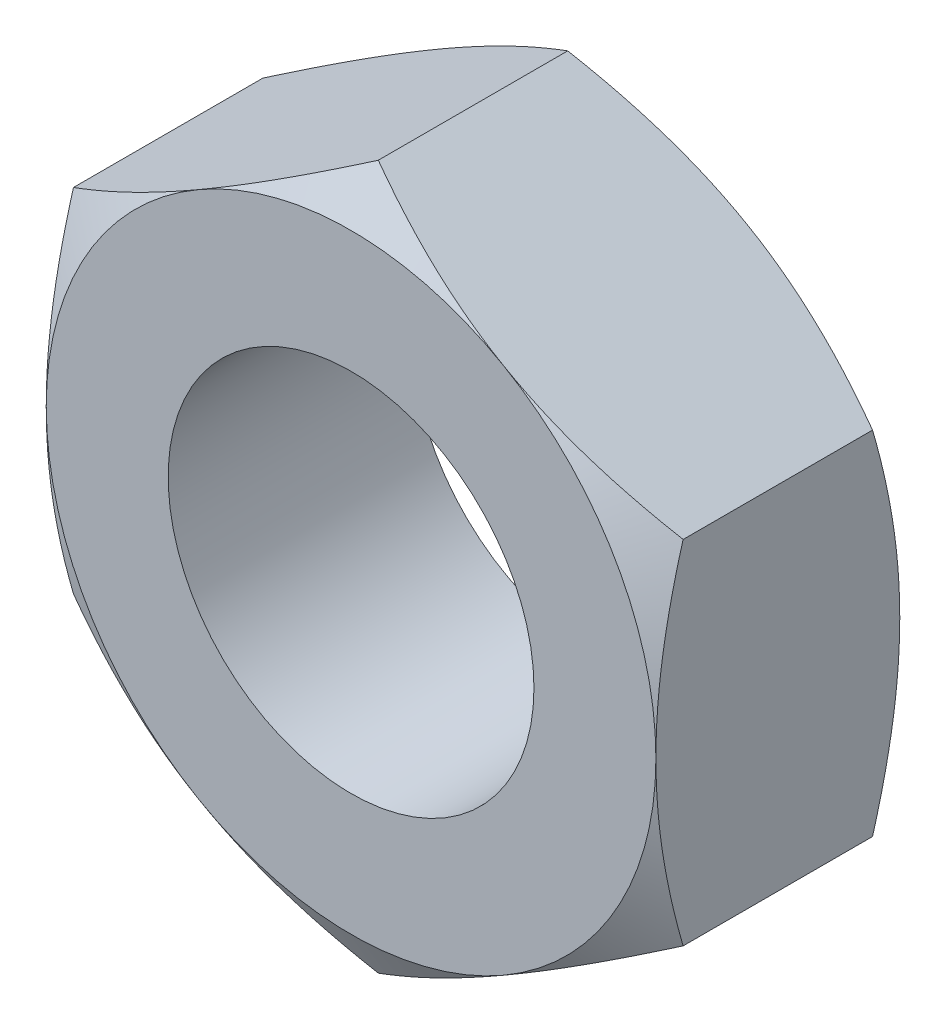
ISO-10303-21;
HEADER;
FILE_DESCRIPTION(('STEP AP214'),'2;1');
FILE_NAME('part.step','',(''),(''),'','','');
FILE_SCHEMA(('AUTOMOTIVE_DESIGN { 1 0 10303 214 1 1 1 1 }'));
ENDSEC;
DATA;
#1=APPLICATION_CONTEXT('core data for automotive mechanical design processes');
#2=APPLICATION_PROTOCOL_DEFINITION('international standard','automotive_design',2000,#1);
#3=PRODUCT_CONTEXT('',#1,'mechanical');
#4=PRODUCT('Part','Part','',(#3));
#5=PRODUCT_RELATED_PRODUCT_CATEGORY('part','',(#4));
#6=PRODUCT_DEFINITION_FORMATION('','',#4);
#7=PRODUCT_DEFINITION_CONTEXT('part definition',#1,'design');
#8=PRODUCT_DEFINITION('design','',#6,#7);
#9=PRODUCT_DEFINITION_SHAPE('','',#8);
#10=(LENGTH_UNIT() NAMED_UNIT(*) SI_UNIT(.MILLI.,.METRE.));
#11=(NAMED_UNIT(*) PLANE_ANGLE_UNIT() SI_UNIT($,.RADIAN.));
#12=(NAMED_UNIT(*) SI_UNIT($,.STERADIAN.) SOLID_ANGLE_UNIT());
#13=UNCERTAINTY_MEASURE_WITH_UNIT(LENGTH_MEASURE(1.E-05),#10,'distance_accuracy_value','');
#14=(GEOMETRIC_REPRESENTATION_CONTEXT(3) GLOBAL_UNCERTAINTY_ASSIGNED_CONTEXT((#13)) GLOBAL_UNIT_ASSIGNED_CONTEXT((#10,
#11,#12)) REPRESENTATION_CONTEXT('',''));
#15=CARTESIAN_POINT('',(0.,0.,0.));
#16=DIRECTION('',(0.,0.,1.));
#17=DIRECTION('',(1.,0.,0.));
#18=AXIS2_PLACEMENT_3D('',#15,#16,#17);
#19=CARTESIAN_POINT('',(-2.49999999999997,-1.44337567297409,2.));
#20=DIRECTION('',(0.499999999999995,0.866025403784441,0.));
#21=DIRECTION('',(-0.866025403784442,0.499999999999995,0.));
#22=AXIS2_PLACEMENT_3D('',#19,#20,#21);
#23=PLANE('',#22);
#24=CARTESIAN_POINT('',(0.000200000000000162,-2.88686681600195,0.2233576643591));
#25=CARTESIAN_POINT('',(-0.109663234734871,-2.82343724785373,0.186721620107618));
#26=CARTESIAN_POINT('',(-0.220474799896525,-2.75946016087833,0.153402218965049));
#27=CARTESIAN_POINT('',(-0.444016833466049,-2.63039810762177,0.0952422855578519));
#28=CARTESIAN_POINT('',(-0.556751274528388,-2.56531084772749,0.0704223291477331));
#29=CARTESIAN_POINT('',(-0.780822993875268,-2.43594298024479,0.0317856514410478));
#30=CARTESIAN_POINT('',(-0.892125791767376,-2.37168227992022,0.0177117961856351));
#31=CARTESIAN_POINT('',(-1.11525522746833,-2.24285844015414,0.000909152352747347));
#32=CARTESIAN_POINT('',(-1.22708105401423,-2.17829576909552,-0.00183354879637574));
#33=CARTESIAN_POINT('',(-1.43604197555152,-2.05765212479586,0.00386576000805192));
#34=CARTESIAN_POINT('',(-1.53320831755773,-2.0015531110824,0.0109083943818601));
#35=CARTESIAN_POINT('',(-1.72690794971099,-1.88972057631678,0.0332314191249406));
#36=CARTESIAN_POINT('',(-1.82344056965972,-1.83398744220381,0.0485194384402649));
#37=CARTESIAN_POINT('',(-2.01753972174046,-1.72192424450051,0.086739093844417));
#38=CARTESIAN_POINT('',(-2.11508168178212,-1.66560836761318,0.109832776125513));
#39=CARTESIAN_POINT('',(-2.30871060807606,-1.55381665489447,0.162246656577907));
#40=CARTESIAN_POINT('',(-2.40480005588615,-1.49833938633504,0.191554535624541));
#41=CARTESIAN_POINT('',(-2.50019999999997,-1.44326020292025,0.2233576643591));
#42=B_SPLINE_CURVE_WITH_KNOTS('',3,(#24,#25,#26,#27,#28,#29,#30,#31,#32,#33,#34,#35,#36,#37,#38,
#39,#40,#41),.UNSPECIFIED.,.F.,.F.,(4,2,2,2,2,2,2,2,4),(0.,0.396285827362224,0.793524330152047,
1.18093086852113,1.56786160134475,1.90479741793731,2.2420455166046,2.58677531536753,
2.93082800105252),.UNSPECIFIED.);
#43=CARTESIAN_POINT('',(0.,-2.88675134594811,0.223290993692593));
#44=VERTEX_POINT('',#43);
#45=CARTESIAN_POINT('',(-1.24999999999999,-2.1650635094611,0.));
#46=VERTEX_POINT('',#45);
#47=EDGE_CURVE('E267',#44,#46,#42,.T.);
#48=ORIENTED_EDGE('',*,*,#47,.F.);
#49=DIRECTION('',(0.,0.,-1.));
#50=VECTOR('',#49,1.);
#51=CARTESIAN_POINT('',(0.,-2.88675134594811,2.));
#52=LINE('',#51,#50);
#53=CARTESIAN_POINT('',(0.,-2.88675134594811,1.77670900630741));
#54=VERTEX_POINT('',#53);
#55=EDGE_CURVE('E310',#54,#44,#52,.T.);
#56=ORIENTED_EDGE('',*,*,#55,.F.);
#57=CARTESIAN_POINT('',(-2.50019999999997,-1.44326020292025,1.7766423356409));
#58=CARTESIAN_POINT('',(-2.3903367652651,-1.50668977106847,1.81327837989238));
#59=CARTESIAN_POINT('',(-2.27952520010345,-1.57066685804387,1.84659778103495));
#60=CARTESIAN_POINT('',(-2.05598316653392,-1.69972891130043,1.90475771444215));
#61=CARTESIAN_POINT('',(-1.94324872547158,-1.76481617119471,1.92957767085227));
#62=CARTESIAN_POINT('',(-1.7191770061247,-1.89418403867742,1.96821434855895));
#63=CARTESIAN_POINT('',(-1.60787420823259,-1.95844473900198,1.98228820381436));
#64=CARTESIAN_POINT('',(-1.38474477253164,-2.08726857876806,1.99909084764725));
#65=CARTESIAN_POINT('',(-1.27291894598575,-2.15183124982668,2.00183354879638));
#66=CARTESIAN_POINT('',(-1.06395802444845,-2.27247489412635,1.99613423999195));
#67=CARTESIAN_POINT('',(-0.966791682442246,-2.3285739078398,1.98909160561814));
#68=CARTESIAN_POINT('',(-0.773092050288979,-2.44040644260542,1.96676858087506));
#69=CARTESIAN_POINT('',(-0.676559430340252,-2.4961395767184,1.95148056155974));
#70=CARTESIAN_POINT('',(-0.482460278259513,-2.60820277442169,1.91326090615558));
#71=CARTESIAN_POINT('',(-0.38491831821785,-2.66451865130902,1.89016722387449));
#72=CARTESIAN_POINT('',(-0.19128939192391,-2.77631036402773,1.83775334342209));
#73=CARTESIAN_POINT('',(-0.0951999441138213,-2.83178763258716,1.80844546437546));
#74=CARTESIAN_POINT('',(0.000200000000000241,-2.88686681600195,1.7766423356409));
#75=B_SPLINE_CURVE_WITH_KNOTS('',3,(#57,#58,#59,#60,#61,#62,#63,#64,#65,#66,#67,#68,#69,#70,#71,
#72,#73,#74),.UNSPECIFIED.,.F.,.F.,(4,2,2,2,2,2,2,2,4),(0.,0.396285827362225,0.793524330152047,
1.18093086852113,1.56786160134475,1.90479741793731,2.2420455166046,2.58677531536753,
2.93082800105252),.UNSPECIFIED.);
#76=CARTESIAN_POINT('',(-1.24999999999999,-2.1650635094611,2.));
#77=VERTEX_POINT('',#76);
#78=EDGE_CURVE('E217',#77,#54,#75,.T.);
#79=ORIENTED_EDGE('',*,*,#78,.F.);
#80=CARTESIAN_POINT('',(-2.49999999999997,-1.44337567297421,1.77670900630749));
#81=VERTEX_POINT('',#80);
#82=EDGE_CURVE('E293',#81,#77,#75,.T.);
#83=ORIENTED_EDGE('',*,*,#82,.F.);
#84=DIRECTION('',(0.,0.,-1.));
#85=VECTOR('',#84,1.);
#86=CARTESIAN_POINT('',(-2.49999999999997,-1.44337567297409,2.));
#87=LINE('',#86,#85);
#88=CARTESIAN_POINT('',(-2.49999999999997,-1.44337567297421,0.223290993692512));
#89=VERTEX_POINT('',#88);
#90=EDGE_CURVE('E290',#81,#89,#87,.T.);
#91=ORIENTED_EDGE('',*,*,#90,.T.);
#92=EDGE_CURVE('E254',#46,#89,#42,.T.);
#93=ORIENTED_EDGE('',*,*,#92,.F.);
#94=EDGE_LOOP('',(#48,#56,#79,#83,#91,#93));
#95=FACE_BOUND('',#94,.T.);
#96=ADVANCED_FACE('F37',(#95),#23,.F.);
#97=CARTESIAN_POINT('',(0.,-2.88675134594811,2.));
#98=DIRECTION('',(-0.500000000000001,0.866025403784438,0.));
#99=DIRECTION('',(-0.866025403784438,-0.500000000000001,0.));
#100=AXIS2_PLACEMENT_3D('',#97,#98,#99);
#101=PLANE('',#100);
#102=CARTESIAN_POINT('',(2.50019999999999,-1.44326020292021,0.2233576643591));
#103=CARTESIAN_POINT('',(2.39033676526512,-1.50668977106843,0.186721620107618));
#104=CARTESIAN_POINT('',(2.27952520010347,-1.57066685804384,0.153402218965048));
#105=CARTESIAN_POINT('',(2.05598316653394,-1.6997289113004,0.0952422855578497));
#106=CARTESIAN_POINT('',(1.94324872547161,-1.76481617119468,0.0704223291477302));
#107=CARTESIAN_POINT('',(1.71917700612473,-1.89418403867739,0.0317856514410439));
#108=CARTESIAN_POINT('',(1.60787420823262,-1.95844473900195,0.0177117961856309));
#109=CARTESIAN_POINT('',(1.38474477253166,-2.08726857876803,0.000909152352742216));
#110=CARTESIAN_POINT('',(1.27291894598577,-2.15183124982665,-0.00183354879638143));
#111=CARTESIAN_POINT('',(1.06395802444848,-2.27247489412632,0.00386576000804523));
#112=CARTESIAN_POINT('',(0.966791682442268,-2.32857390783978,0.0109083943818532));
#113=CARTESIAN_POINT('',(0.773092050288997,-2.4404064426054,0.033231419124934));
#114=CARTESIAN_POINT('',(0.676559430340268,-2.49613957671838,0.0485194384402587));
#115=CARTESIAN_POINT('',(0.482460278259524,-2.60820277442168,0.0867390938444119));
#116=CARTESIAN_POINT('',(0.384918318217859,-2.66451865130902,0.109832776125509));
#117=CARTESIAN_POINT('',(0.191289391923915,-2.77631036402772,0.162246656577905));
#118=CARTESIAN_POINT('',(0.0951999441138241,-2.83178763258716,0.19155453562454));
#119=CARTESIAN_POINT('',(-0.000199999999999883,-2.88686681600195,0.2233576643591));
#120=B_SPLINE_CURVE_WITH_KNOTS('',3,(#102,#103,#104,#105,#106,#107,#108,#109,#110,#111,#112,
#113,#114,#115,#116,#117,#118,#119),.UNSPECIFIED.,.F.,.F.,(4,2,2,2,2,2,2,2,4),(0.,
0.396285827362225,0.793524330152047,1.18093086852113,1.56786160134475,1.90479741793732,
2.24204551660462,2.58677531536755,2.93082800105256),.UNSPECIFIED.);
#121=CARTESIAN_POINT('',(2.49999999999999,-1.44337567297405,0.223290993692593));
#122=VERTEX_POINT('',#121);
#123=CARTESIAN_POINT('',(1.25,-2.1650635094611,0.));
#124=VERTEX_POINT('',#123);
#125=EDGE_CURVE('E145',#122,#124,#120,.T.);
#126=ORIENTED_EDGE('',*,*,#125,.F.);
#127=DIRECTION('',(0.,0.,-1.));
#128=VECTOR('',#127,1.);
#129=CARTESIAN_POINT('',(2.49999999999999,-1.44337567297405,2.));
#130=LINE('',#129,#128);
#131=CARTESIAN_POINT('',(2.49999999999999,-1.44337567297417,1.77670900630749));
#132=VERTEX_POINT('',#131);
#133=EDGE_CURVE('E157',#132,#122,#130,.T.);
#134=ORIENTED_EDGE('',*,*,#133,.F.);
#135=CARTESIAN_POINT('',(-0.000200000000000074,-2.88686681600195,1.7766423356409));
#136=CARTESIAN_POINT('',(0.10966323473487,-2.82343724785373,1.81327837989238));
#137=CARTESIAN_POINT('',(0.220474799896524,-2.75946016087833,1.84659778103495));
#138=CARTESIAN_POINT('',(0.444016833466047,-2.63039810762177,1.90475771444215));
#139=CARTESIAN_POINT('',(0.556751274528385,-2.56531084772748,1.92957767085227));
#140=CARTESIAN_POINT('',(0.780822993875264,-2.43594298024478,1.96821434855896));
#141=CARTESIAN_POINT('',(0.892125791767372,-2.37168227992021,1.98228820381437));
#142=CARTESIAN_POINT('',(1.11525522746833,-2.24285844015414,1.99909084764726));
#143=CARTESIAN_POINT('',(1.22708105401422,-2.17829576909551,2.00183354879638));
#144=CARTESIAN_POINT('',(1.43604197555151,-2.05765212479585,1.99613423999195));
#145=CARTESIAN_POINT('',(1.53320831755772,-2.00155311108239,1.98909160561815));
#146=CARTESIAN_POINT('',(1.72690794971099,-1.88972057631677,1.96676858087507));
#147=CARTESIAN_POINT('',(1.82344056965972,-1.83398744220379,1.95148056155974));
#148=CARTESIAN_POINT('',(2.01753972174047,-1.72192424450049,1.91326090615559));
#149=CARTESIAN_POINT('',(2.11508168178213,-1.66560836761315,1.89016722387449));
#150=CARTESIAN_POINT('',(2.30871060807608,-1.55381665489444,1.8377533434221));
#151=CARTESIAN_POINT('',(2.40480005588617,-1.49833938633501,1.80844546437546));
#152=CARTESIAN_POINT('',(2.50019999999999,-1.44326020292021,1.7766423356409));
#153=B_SPLINE_CURVE_WITH_KNOTS('',3,(#135,#136,#137,#138,#139,#140,#141,#142,#143,#144,#145,
#146,#147,#148,#149,#150,#151,#152),.UNSPECIFIED.,.F.,.F.,(4,2,2,2,2,2,2,2,4),(0.,
0.396285827362224,0.793524330152047,1.18093086852113,1.56786160134475,1.90479741793732,
2.24204551660462,2.58677531536755,2.93082800105256),.UNSPECIFIED.);
#154=CARTESIAN_POINT('',(1.25,-2.16506350946108,2.));
#155=VERTEX_POINT('',#154);
#156=EDGE_CURVE('E200',#155,#132,#153,.T.);
#157=ORIENTED_EDGE('',*,*,#156,.F.);
#158=EDGE_CURVE('E334',#54,#155,#153,.T.);
#159=ORIENTED_EDGE('',*,*,#158,.F.);
#160=ORIENTED_EDGE('',*,*,#55,.T.);
#161=EDGE_CURVE('E167',#124,#44,#120,.T.);
#162=ORIENTED_EDGE('',*,*,#161,.F.);
#163=EDGE_LOOP('',(#126,#134,#157,#159,#160,#162));
#164=FACE_BOUND('',#163,.T.);
#165=ADVANCED_FACE('F180',(#164),#101,.F.);
#166=CARTESIAN_POINT('',(2.49999999999999,-1.44337567297405,2.));
#167=DIRECTION('',(-1.,0.,0.));
#168=DIRECTION('',(0.,-1.,0.));
#169=AXIS2_PLACEMENT_3D('',#166,#167,#168);
#170=PLANE('',#169);
#171=CARTESIAN_POINT('',(2.5,-3.93425573570174,1.24786742231988));
#172=CARTESIAN_POINT('',(2.5,-3.82455805271518,1.19442683286789));
#173=CARTESIAN_POINT('',(2.5,-3.71461458124995,1.1414824250811));
#174=CARTESIAN_POINT('',(2.5,-3.49410553801961,1.03686398179162));
#175=CARTESIAN_POINT('',(2.5,-3.38353987636771,0.985190135952728));
#176=CARTESIAN_POINT('',(2.5,-3.1611133721341,0.883143029913734));
#177=CARTESIAN_POINT('',(2.5,-3.04924878665415,0.832777900698826));
#178=CARTESIAN_POINT('',(2.5,-2.8246495074574,0.734034164431113));
#179=CARTESIAN_POINT('',(2.5,-2.71191485354297,0.685655467138938));
#180=CARTESIAN_POINT('',(2.49999999999999,-2.4815726289783,0.589816347587659));
#181=CARTESIAN_POINT('',(2.49999999999999,-2.36392903093314,0.542442056681136));
#182=CARTESIAN_POINT('',(2.49999999999999,-2.12728680673992,0.451142480581939));
#183=CARTESIAN_POINT('',(2.49999999999999,-2.00828803339158,0.407217574235718));
#184=CARTESIAN_POINT('',(2.49999999999999,-1.76895086303134,0.323927966543298));
#185=CARTESIAN_POINT('',(2.49999999999999,-1.64861554144244,0.284554513885219));
#186=CARTESIAN_POINT('',(2.49999999999999,-1.40621964850133,0.21159319438697));
#187=CARTESIAN_POINT('',(2.49999999999999,-1.28415961496497,0.178003565258964));
#188=CARTESIAN_POINT('',(2.49999999999999,-1.0389195188697,0.118361804718263));
#189=CARTESIAN_POINT('',(2.49999999999999,-0.915749874741587,0.0922676059427502));
#190=CARTESIAN_POINT('',(2.49999999999999,-0.667820858109997,0.0490550373819117));
#191=CARTESIAN_POINT('',(2.49999999999999,-0.543061659325973,0.0319356952253109));
#192=CARTESIAN_POINT('',(2.49999999999999,-0.294229286789481,0.00825976303698975));
#193=CARTESIAN_POINT('',(2.49999999999999,-0.170169796196182,0.0015629187993084));
#194=CARTESIAN_POINT('',(2.49999999999999,0.0780766731615942,-0.00107330125971436));
#195=CARTESIAN_POINT('',(2.49999999999999,0.202263653840971,0.00298748693341116));
#196=CARTESIAN_POINT('',(2.49999999999998,0.411409604725348,0.0185927331632678));
#197=CARTESIAN_POINT('',(2.49999999999998,0.496584671497748,0.0274243081141329));
#198=CARTESIAN_POINT('',(2.49999999999998,0.666344730959548,0.0496284777980075));
#199=CARTESIAN_POINT('',(2.49999999999998,0.750929648415659,0.063001641083345));
#200=CARTESIAN_POINT('',(2.49999999999998,1.00366548007522,0.109234028667318));
#201=CARTESIAN_POINT('',(2.49999999999998,1.17071375552299,0.148199044449048));
#202=CARTESIAN_POINT('',(2.49999999999998,1.4206286514283,0.216203518781425));
#203=CARTESIAN_POINT('',(2.49999999999998,1.50477790209398,0.240801494595756));
#204=CARTESIAN_POINT('',(2.49999999999998,1.67225987920894,0.292660070165323));
#205=CARTESIAN_POINT('',(2.49999999999998,1.75559259937951,0.319920690377339));
#206=CARTESIAN_POINT('',(2.49999999999998,1.92146681890304,0.376658162164918));
#207=CARTESIAN_POINT('',(2.49999999999998,2.00400853495824,0.406134385980853));
#208=CARTESIAN_POINT('',(2.49999999999998,2.16840002368736,0.466945522238705));
#209=CARTESIAN_POINT('',(2.49999999999998,2.25024981200959,0.498280392517164));
#210=CARTESIAN_POINT('',(2.49999999999998,2.47007598379912,0.584843598085943));
#211=CARTESIAN_POINT('',(2.49999999999998,2.60747896260624,0.641526709598319));
#212=CARTESIAN_POINT('',(2.49999999999998,2.88087320813983,0.758212721815775));
#213=CARTESIAN_POINT('',(2.49999999999998,3.01686431759797,0.818215987739867));
#214=CARTESIAN_POINT('',(2.49999999999997,3.28775371033888,0.940755016909798));
#215=CARTESIAN_POINT('',(2.49999999999997,3.42265159883759,1.00329165002619));
#216=CARTESIAN_POINT('',(2.49999999999997,3.69153349617871,1.13030325926438));
#217=CARTESIAN_POINT('',(2.49999999999997,3.82551747693042,1.19477829464024));
#218=CARTESIAN_POINT('',(2.49999999999997,4.22678780318403,1.39065285591914));
#219=CARTESIAN_POINT('',(2.49999999999997,4.49297167508688,1.52430796749618));
#220=CARTESIAN_POINT('',(2.49999999999997,5.02332787108775,1.79538779124832));
#221=CARTESIAN_POINT('',(2.49999999999997,5.28750060208648,1.93281171353398));
#222=CARTESIAN_POINT('',(2.49999999999997,5.78669441053013,2.19560284746361));
#223=CARTESIAN_POINT('',(2.49999999999997,6.02185115865901,2.32071278514315));
#224=CARTESIAN_POINT('',(2.49999999999996,6.49137306636739,2.57244119196158));
#225=CARTESIAN_POINT('',(2.49999999999996,6.7257381764787,2.69905975321281));
#226=CARTESIAN_POINT('',(2.49999999999996,7.19307672107728,2.95299069470952));
#227=CARTESIAN_POINT('',(2.49999999999996,7.42605218847075,3.08029933799));
#228=CARTESIAN_POINT('',(2.49999999999996,7.89150863123006,3.33577450416362));
#229=CARTESIAN_POINT('',(2.49999999999996,8.12398964405185,3.46394095878685));
#230=CARTESIAN_POINT('',(2.49999999999996,8.35629687842252,3.59241944863064));
#231=B_SPLINE_CURVE_WITH_KNOTS('',3,(#171,#172,#173,#174,#175,#176,#177,#178,#179,#180,#181,
#182,#183,#184,#185,#186,#187,#188,#189,#190,#191,#192,#193,#194,#195,#196,#197,#198,#199,#200,
#201,#202,#203,#204,#205,#206,#207,#208,#209,#210,#211,#212,#213,#214,#215,#216,#217,#218,#219,
#220,#221,#222,#223,#224,#225,#226,#227,#228,#229,#230),.UNSPECIFIED.,.F.,.F.,(4,2,2,2,2,2,2,2,
2,2,2,2,2,2,2,2,2,2,2,2,2,2,2,2,2,2,2,2,2,4),(0.,0.366071555956611,0.732197429693603,
1.10022131466406,1.46822846255462,1.84865877257403,2.22913080704688,2.60885867248576,
2.98847063215674,3.36590845840163,3.74330538309199,4.11557841167118,4.4878571160823,
4.74462879425845,5.00143262902233,5.51529120295764,5.7782794978535,6.04126981341614,
6.30418589329148,6.56709601118611,7.01293774320754,7.45882861596655,7.9048739119297,
8.35093285672014,9.24444046413292,10.1377622149405,10.9368546431961,11.7359961144143,
12.5324647674532,13.3288707690047),.UNSPECIFIED.);
#232=CARTESIAN_POINT('',(2.49999999999998,1.44337567297407,0.223290993692593));
#233=VERTEX_POINT('',#232);
#234=CARTESIAN_POINT('',(2.5,0.,0.));
#235=VERTEX_POINT('',#234);
#236=EDGE_CURVE('E126',#233,#235,#231,.F.);
#237=ORIENTED_EDGE('',*,*,#236,.F.);
#238=DIRECTION('',(0.,0.,-1.));
#239=VECTOR('',#238,1.);
#240=CARTESIAN_POINT('',(2.49999999999998,1.44337567297407,2.));
#241=LINE('',#240,#239);
#242=CARTESIAN_POINT('',(2.49999999999998,1.44337567297407,1.77670900630741));
#243=VERTEX_POINT('',#242);
#244=EDGE_CURVE('E308',#243,#233,#241,.T.);
#245=ORIENTED_EDGE('',*,*,#244,.F.);
#246=CARTESIAN_POINT('',(2.5,-3.93425573570174,0.752132577680122));
#247=CARTESIAN_POINT('',(2.5,-3.82455805271518,0.805573167132106));
#248=CARTESIAN_POINT('',(2.5,-3.71461458124995,0.858517574918903));
#249=CARTESIAN_POINT('',(2.5,-3.49410553801961,0.96313601820838));
#250=CARTESIAN_POINT('',(2.5,-3.3835398763677,1.01480986404727));
#251=CARTESIAN_POINT('',(2.5,-3.1611133721341,1.11685697008627));
#252=CARTESIAN_POINT('',(2.5,-3.04924878665415,1.16722209930117));
#253=CARTESIAN_POINT('',(2.5,-2.8246495074574,1.26596583556889));
#254=CARTESIAN_POINT('',(2.5,-2.71191485354297,1.31434453286106));
#255=CARTESIAN_POINT('',(2.49999999999999,-2.4815726289783,1.41018365241234));
#256=CARTESIAN_POINT('',(2.49999999999999,-2.36392903093314,1.45755794331886));
#257=CARTESIAN_POINT('',(2.49999999999999,-2.12728680673992,1.54885751941806));
#258=CARTESIAN_POINT('',(2.49999999999999,-2.00828803339158,1.59278242576428));
#259=CARTESIAN_POINT('',(2.49999999999999,-1.76895086303134,1.6760720334567));
#260=CARTESIAN_POINT('',(2.49999999999999,-1.64861554144244,1.71544548611478));
#261=CARTESIAN_POINT('',(2.49999999999999,-1.40621964850133,1.78840680561303));
#262=CARTESIAN_POINT('',(2.49999999999999,-1.28415961496497,1.82199643474104));
#263=CARTESIAN_POINT('',(2.49999999999999,-1.0389195188697,1.88163819528174));
#264=CARTESIAN_POINT('',(2.49999999999999,-0.915749874741587,1.90773239405725));
#265=CARTESIAN_POINT('',(2.49999999999999,-0.667820858109997,1.95094496261809));
#266=CARTESIAN_POINT('',(2.49999999999999,-0.543061659325972,1.96806430477469));
#267=CARTESIAN_POINT('',(2.49999999999999,-0.294229286789481,1.99174023696301));
#268=CARTESIAN_POINT('',(2.49999999999999,-0.170169796196181,1.99843708120069));
#269=CARTESIAN_POINT('',(2.49999999999999,0.0780766731615949,2.00107330125971));
#270=CARTESIAN_POINT('',(2.49999999999999,0.202263653840971,1.99701251306659));
#271=CARTESIAN_POINT('',(2.49999999999998,0.411409604725348,1.98140726683673));
#272=CARTESIAN_POINT('',(2.49999999999998,0.496584671497748,1.97257569188587));
#273=CARTESIAN_POINT('',(2.49999999999998,0.666344730959547,1.95037152220199));
#274=CARTESIAN_POINT('',(2.49999999999998,0.750929648415658,1.93699835891666));
#275=CARTESIAN_POINT('',(2.49999999999998,1.00366548007522,1.89076597133268));
#276=CARTESIAN_POINT('',(2.49999999999998,1.17071375552299,1.85180095555095));
#277=CARTESIAN_POINT('',(2.49999999999998,1.4206286514283,1.78379648121857));
#278=CARTESIAN_POINT('',(2.49999999999998,1.50477790209398,1.75919850540424));
#279=CARTESIAN_POINT('',(2.49999999999998,1.67225987920894,1.70733992983468));
#280=CARTESIAN_POINT('',(2.49999999999998,1.75559259937951,1.68007930962266));
#281=CARTESIAN_POINT('',(2.49999999999998,1.92146681890304,1.62334183783508));
#282=CARTESIAN_POINT('',(2.49999999999998,2.00400853495824,1.59386561401915));
#283=CARTESIAN_POINT('',(2.49999999999998,2.16840002368736,1.53305447776129));
#284=CARTESIAN_POINT('',(2.49999999999998,2.25024981200959,1.50171960748284));
#285=CARTESIAN_POINT('',(2.49999999999998,2.47007598379913,1.41515640191406));
#286=CARTESIAN_POINT('',(2.49999999999998,2.60747896260624,1.35847329040168));
#287=CARTESIAN_POINT('',(2.49999999999998,2.88087320813983,1.24178727818422));
#288=CARTESIAN_POINT('',(2.49999999999998,3.01686431759797,1.18178401226013));
#289=CARTESIAN_POINT('',(2.49999999999997,3.28775371033888,1.0592449830902));
#290=CARTESIAN_POINT('',(2.49999999999997,3.42265159883759,0.996708349973814));
#291=CARTESIAN_POINT('',(2.49999999999997,3.69153349617871,0.86969674073562));
#292=CARTESIAN_POINT('',(2.49999999999997,3.82551747693042,0.805221705359762));
#293=CARTESIAN_POINT('',(2.49999999999997,4.22678780318403,0.609347144080856));
#294=CARTESIAN_POINT('',(2.49999999999997,4.49297167508688,0.475692032503817));
#295=CARTESIAN_POINT('',(2.49999999999997,5.02332787108775,0.204612208751678));
#296=CARTESIAN_POINT('',(2.49999999999997,5.28750060208648,0.0671882864660215));
#297=CARTESIAN_POINT('',(2.49999999999997,5.78669441053013,-0.195602847463607));
#298=CARTESIAN_POINT('',(2.49999999999997,6.02185115865901,-0.320712785143147));
#299=CARTESIAN_POINT('',(2.49999999999996,6.49137306636739,-0.572441191961576));
#300=CARTESIAN_POINT('',(2.49999999999996,6.7257381764787,-0.699059753212815));
#301=CARTESIAN_POINT('',(2.49999999999996,7.19307672107728,-0.952990694709516));
#302=CARTESIAN_POINT('',(2.49999999999996,7.42605218847075,-1.08029933799));
#303=CARTESIAN_POINT('',(2.49999999999996,7.89150863123006,-1.33577450416362));
#304=CARTESIAN_POINT('',(2.49999999999996,8.12398964405185,-1.46394095878685));
#305=CARTESIAN_POINT('',(2.49999999999996,8.35629687842252,-1.59241944863064));
#306=B_SPLINE_CURVE_WITH_KNOTS('',3,(#246,#247,#248,#249,#250,#251,#252,#253,#254,#255,#256,
#257,#258,#259,#260,#261,#262,#263,#264,#265,#266,#267,#268,#269,#270,#271,#272,#273,#274,#275,
#276,#277,#278,#279,#280,#281,#282,#283,#284,#285,#286,#287,#288,#289,#290,#291,#292,#293,#294,
#295,#296,#297,#298,#299,#300,#301,#302,#303,#304,#305),.UNSPECIFIED.,.F.,.F.,(4,2,2,2,2,2,2,2,
2,2,2,2,2,2,2,2,2,2,2,2,2,2,2,2,2,2,2,2,2,4),(0.,0.366071555956611,0.732197429693603,
1.10022131466407,1.46822846255462,1.84865877257403,2.22913080704688,2.60885867248576,
2.98847063215674,3.36590845840163,3.74330538309199,4.11557841167118,4.4878571160823,
4.74462879425845,5.00143262902233,5.51529120295764,5.7782794978535,6.04126981341614,
6.30418589329148,6.56709601118611,7.01293774320754,7.45882861596655,7.9048739119297,
8.35093285672014,9.24444046413292,10.1377622149405,10.9368546431961,11.7359961144143,
12.5324647674532,13.3288707690047),.UNSPECIFIED.);
#307=CARTESIAN_POINT('',(2.49999999999999,0.,2.));
#308=VERTEX_POINT('',#307);
#309=EDGE_CURVE('E186',#308,#243,#306,.T.);
#310=ORIENTED_EDGE('',*,*,#309,.F.);
#311=EDGE_CURVE('E193',#132,#308,#306,.T.);
#312=ORIENTED_EDGE('',*,*,#311,.F.);
#313=ORIENTED_EDGE('',*,*,#133,.T.);
#314=EDGE_CURVE('E138',#235,#122,#231,.F.);
#315=ORIENTED_EDGE('',*,*,#314,.F.);
#316=EDGE_LOOP('',(#237,#245,#310,#312,#313,#315));
#317=FACE_BOUND('',#316,.T.);
#318=ADVANCED_FACE('F154',(#317),#170,.F.);
#319=CARTESIAN_POINT('',(2.49999999999998,1.44337567297407,2.));
#320=DIRECTION('',(-0.499999999999995,-0.866025403784442,0.));
#321=DIRECTION('',(0.866025403784442,-0.499999999999995,0.));
#322=AXIS2_PLACEMENT_3D('',#319,#320,#321);
#323=PLANE('',#322);
#324=CARTESIAN_POINT('',(-0.000200000000020158,2.88686681600195,0.2233576643591));
#325=CARTESIAN_POINT('',(0.109663234734851,2.82343724785373,0.186721620107617));
#326=CARTESIAN_POINT('',(0.220474799896505,2.75946016087833,0.153402218965048));
#327=CARTESIAN_POINT('',(0.444016833466029,2.63039810762177,0.0952422855578498));
#328=CARTESIAN_POINT('',(0.556751274528367,2.56531084772749,0.0704223291477303));
#329=CARTESIAN_POINT('',(0.780822993875247,2.43594298024479,0.0317856514410441));
#330=CARTESIAN_POINT('',(0.892125791767355,2.37168227992022,0.017711796185631));
#331=CARTESIAN_POINT('',(1.11525522746831,2.24285844015414,0.000909152352742206));
#332=CARTESIAN_POINT('',(1.2270810540142,2.17829576909552,-0.00183354879638151));
#333=CARTESIAN_POINT('',(1.4360419755515,2.05765212479586,0.00386576000804518));
#334=CARTESIAN_POINT('',(1.53320831755771,2.0015531110824,0.0109083943818533));
#335=CARTESIAN_POINT('',(1.72690794971098,1.88972057631678,0.033231419124934));
#336=CARTESIAN_POINT('',(1.82344056965971,1.8339874422038,0.0485194384402585));
#337=CARTESIAN_POINT('',(2.01753972174046,1.7219242445005,0.0867390938444117));
#338=CARTESIAN_POINT('',(2.11508168178212,1.66560836761317,0.109832776125508));
#339=CARTESIAN_POINT('',(2.30871060807607,1.55381665489446,0.162246656577905));
#340=CARTESIAN_POINT('',(2.40480005588616,1.49833938633502,0.19155453562454));
#341=CARTESIAN_POINT('',(2.50019999999998,1.44326020292023,0.2233576643591));
#342=B_SPLINE_CURVE_WITH_KNOTS('',3,(#324,#325,#326,#327,#328,#329,#330,#331,#332,#333,#334,
#335,#336,#337,#338,#339,#340,#341),.UNSPECIFIED.,.F.,.F.,(4,2,2,2,2,2,2,2,4),(0.,
0.396285827362224,0.793524330152047,1.18093086852113,1.56786160134475,1.90479741793732,
2.24204551660462,2.58677531536755,2.93082800105256),.UNSPECIFIED.);
#343=CARTESIAN_POINT('',(0.,2.88675134594811,0.223290993692593));
#344=VERTEX_POINT('',#343);
#345=CARTESIAN_POINT('',(1.24999999999999,2.1650635094611,0.));
#346=VERTEX_POINT('',#345);
#347=EDGE_CURVE('E53',#344,#346,#342,.T.);
#348=ORIENTED_EDGE('',*,*,#347,.F.);
#349=DIRECTION('',(0.,0.,-1.));
#350=VECTOR('',#349,1.);
#351=CARTESIAN_POINT('',(0.,2.88675134594811,2.));
#352=LINE('',#351,#350);
#353=CARTESIAN_POINT('',(0.,2.88675134594811,1.77670900630741));
#354=VERTEX_POINT('',#353);
#355=EDGE_CURVE('E300',#354,#344,#352,.T.);
#356=ORIENTED_EDGE('',*,*,#355,.F.);
#357=CARTESIAN_POINT('',(2.50019999999998,1.44326020292023,1.7766423356409));
#358=CARTESIAN_POINT('',(2.39033676526511,1.50668977106845,1.81327837989238));
#359=CARTESIAN_POINT('',(2.27952520010346,1.57066685804385,1.84659778103495));
#360=CARTESIAN_POINT('',(2.05598316653393,1.69972891130041,1.90475771444215));
#361=CARTESIAN_POINT('',(1.94324872547159,1.7648161711947,1.92957767085227));
#362=CARTESIAN_POINT('',(1.71917700612471,1.8941840386774,1.96821434855896));
#363=CARTESIAN_POINT('',(1.60787420823261,1.95844473900196,1.98228820381437));
#364=CARTESIAN_POINT('',(1.38474477253165,2.08726857876804,1.99909084764726));
#365=CARTESIAN_POINT('',(1.27291894598576,2.15183124982666,2.00183354879638));
#366=CARTESIAN_POINT('',(1.06395802444846,2.27247489412633,1.99613423999195));
#367=CARTESIAN_POINT('',(0.966791682442252,2.32857390783979,1.98909160561815));
#368=CARTESIAN_POINT('',(0.77309205028898,2.44040644260541,1.96676858087507));
#369=CARTESIAN_POINT('',(0.67655943034025,2.49613957671839,1.95148056155974));
#370=CARTESIAN_POINT('',(0.482460278259505,2.60820277442168,1.91326090615559));
#371=CARTESIAN_POINT('',(0.384918318217841,2.66451865130902,1.89016722387449));
#372=CARTESIAN_POINT('',(0.191289391923895,2.77631036402772,1.8377533434221));
#373=CARTESIAN_POINT('',(0.0951999441138043,2.83178763258716,1.80844546437546));
#374=CARTESIAN_POINT('',(-0.000200000000020008,2.88686681600195,1.7766423356409));
#375=B_SPLINE_CURVE_WITH_KNOTS('',3,(#357,#358,#359,#360,#361,#362,#363,#364,#365,#366,#367,
#368,#369,#370,#371,#372,#373,#374),.UNSPECIFIED.,.F.,.F.,(4,2,2,2,2,2,2,2,4),(0.,
0.396285827362225,0.793524330152047,1.18093086852113,1.56786160134475,1.90479741793732,
2.24204551660462,2.58677531536755,2.93082800105256),.UNSPECIFIED.);
#376=CARTESIAN_POINT('',(1.24999999999998,2.16506350946109,2.));
#377=VERTEX_POINT('',#376);
#378=EDGE_CURVE('E195',#377,#354,#375,.T.);
#379=ORIENTED_EDGE('',*,*,#378,.F.);
#380=EDGE_CURVE('E194',#243,#377,#375,.T.);
#381=ORIENTED_EDGE('',*,*,#380,.F.);
#382=ORIENTED_EDGE('',*,*,#244,.T.);
#383=EDGE_CURVE('E132',#346,#233,#342,.T.);
#384=ORIENTED_EDGE('',*,*,#383,.F.);
#385=EDGE_LOOP('',(#348,#356,#379,#381,#382,#384));
#386=FACE_BOUND('',#385,.T.);
#387=ADVANCED_FACE('F179',(#386),#323,.F.);
#388=CARTESIAN_POINT('',(0.,2.88675134594811,2.));
#389=DIRECTION('',(0.500000000000007,-0.866025403784435,0.));
#390=DIRECTION('',(0.866025403784434,0.500000000000007,0.));
#391=AXIS2_PLACEMENT_3D('',#388,#389,#390);
#392=PLANE('',#391);
#393=CARTESIAN_POINT('',(-2.5002,1.4432602029202,0.2233576643591));
#394=CARTESIAN_POINT('',(-2.39033676526513,1.50668977106842,0.186721620107617));
#395=CARTESIAN_POINT('',(-2.27952520010348,1.57066685804382,0.153402218965048));
#396=CARTESIAN_POINT('',(-2.05598316653396,1.69972891130039,0.0952422855578498));
#397=CARTESIAN_POINT('',(-1.94324872547162,1.76481617119467,0.0704223291477304));
#398=CARTESIAN_POINT('',(-1.71917700612474,1.89418403867737,0.0317856514410441));
#399=CARTESIAN_POINT('',(-1.60787420823263,1.95844473900194,0.0177117961856308));
#400=CARTESIAN_POINT('',(-1.38474477253168,2.08726857876802,0.000909152352742026));
#401=CARTESIAN_POINT('',(-1.27291894598579,2.15183124982664,-0.00183354879638151));
#402=CARTESIAN_POINT('',(-1.0639580244485,2.27247489412631,0.00386576000804529));
#403=CARTESIAN_POINT('',(-0.966791682442284,2.32857390783977,0.0109083943818533));
#404=CARTESIAN_POINT('',(-0.773092050289014,2.4404064426054,0.0332314191249341));
#405=CARTESIAN_POINT('',(-0.676559430340285,2.49613957671838,0.0485194384402587));
#406=CARTESIAN_POINT('',(-0.482460278259542,2.60820277442167,0.0867390938444119));
#407=CARTESIAN_POINT('',(-0.384918318217878,2.66451865130901,0.109832776125509));
#408=CARTESIAN_POINT('',(-0.191289391923934,2.77631036402772,0.162246656577905));
#409=CARTESIAN_POINT('',(-0.0951999441138436,2.83178763258716,0.19155453562454));
#410=CARTESIAN_POINT('',(0.000199999999980036,2.88686681600195,0.2233576643591));
#411=B_SPLINE_CURVE_WITH_KNOTS('',3,(#393,#394,#395,#396,#397,#398,#399,#400,#401,#402,#403,
#404,#405,#406,#407,#408,#409,#410),.UNSPECIFIED.,.F.,.F.,(4,2,2,2,2,2,2,2,4),(0.,
0.396285827362225,0.793524330152046,1.18093086852113,1.56786160134475,1.90479741793732,
2.24204551660462,2.58677531536755,2.93082800105256),.UNSPECIFIED.);
#412=CARTESIAN_POINT('',(-2.5,1.44337567297403,0.223290993692593));
#413=VERTEX_POINT('',#412);
#414=CARTESIAN_POINT('',(-1.25000000000002,2.16506350946109,0.));
#415=VERTEX_POINT('',#414);
#416=EDGE_CURVE('E60',#413,#415,#411,.T.);
#417=ORIENTED_EDGE('',*,*,#416,.F.);
#418=DIRECTION('',(0.,0.,-1.));
#419=VECTOR('',#418,1.);
#420=CARTESIAN_POINT('',(-2.5,1.44337567297403,2.));
#421=LINE('',#420,#419);
#422=CARTESIAN_POINT('',(-2.5,1.44337567297403,1.77670900630741));
#423=VERTEX_POINT('',#422);
#424=EDGE_CURVE('E296',#423,#413,#421,.T.);
#425=ORIENTED_EDGE('',*,*,#424,.F.);
#426=CARTESIAN_POINT('',(0.000199999999979915,2.88686681600195,1.7766423356409));
#427=CARTESIAN_POINT('',(-0.10966323473489,2.82343724785373,1.81327837989238));
#428=CARTESIAN_POINT('',(-0.220474799896544,2.75946016087833,1.84659778103495));
#429=CARTESIAN_POINT('',(-0.444016833466065,2.63039810762176,1.90475771444215));
#430=CARTESIAN_POINT('',(-0.556751274528403,2.56531084772748,1.92957767085227));
#431=CARTESIAN_POINT('',(-0.780822993875281,2.43594298024477,1.96821434855896));
#432=CARTESIAN_POINT('',(-0.892125791767388,2.37168227992021,1.98228820381437));
#433=CARTESIAN_POINT('',(-1.11525522746834,2.24285844015413,1.99909084764726));
#434=CARTESIAN_POINT('',(-1.22708105401423,2.17829576909551,2.00183354879638));
#435=CARTESIAN_POINT('',(-1.43604197555153,2.05765212479584,1.99613423999195));
#436=CARTESIAN_POINT('',(-1.53320831755774,2.00155311108238,1.98909160561815));
#437=CARTESIAN_POINT('',(-1.72690794971101,1.88972057631675,1.96676858087507));
#438=CARTESIAN_POINT('',(-1.82344056965974,1.83398744220377,1.95148056155974));
#439=CARTESIAN_POINT('',(-2.01753972174048,1.72192424450048,1.91326090615559));
#440=CARTESIAN_POINT('',(-2.11508168178214,1.66560836761314,1.89016722387449));
#441=CARTESIAN_POINT('',(-2.30871060807609,1.55381665489443,1.8377533434221));
#442=CARTESIAN_POINT('',(-2.40480005588618,1.49833938633499,1.80844546437546));
#443=CARTESIAN_POINT('',(-2.5002,1.4432602029202,1.7766423356409));
#444=B_SPLINE_CURVE_WITH_KNOTS('',3,(#426,#427,#428,#429,#430,#431,#432,#433,#434,#435,#436,
#437,#438,#439,#440,#441,#442,#443),.UNSPECIFIED.,.F.,.F.,(4,2,2,2,2,2,2,2,4),(0.,
0.396285827362225,0.793524330152047,1.18093086852113,1.56786160134475,1.90479741793732,
2.24204551660462,2.58677531536755,2.93082800105256),.UNSPECIFIED.);
#445=CARTESIAN_POINT('',(-1.25000000000001,2.16506350946107,2.));
#446=VERTEX_POINT('',#445);
#447=EDGE_CURVE('E233',#446,#423,#444,.T.);
#448=ORIENTED_EDGE('',*,*,#447,.F.);
#449=EDGE_CURVE('E238',#354,#446,#444,.T.);
#450=ORIENTED_EDGE('',*,*,#449,.F.);
#451=ORIENTED_EDGE('',*,*,#355,.T.);
#452=EDGE_CURVE('E256',#415,#344,#411,.T.);
#453=ORIENTED_EDGE('',*,*,#452,.F.);
#454=EDGE_LOOP('',(#417,#425,#448,#450,#451,#453));
#455=FACE_BOUND('',#454,.T.);
#456=ADVANCED_FACE('F239',(#455),#392,.F.);
#457=CARTESIAN_POINT('',(-2.5,1.44337567297403,2.));
#458=DIRECTION('',(1.,0.,0.));
#459=DIRECTION('',(0.,1.,0.));
#460=AXIS2_PLACEMENT_3D('',#457,#458,#459);
#461=PLANE('',#460);
#462=CARTESIAN_POINT('',(-2.49999999999995,-3.93425573570178,1.24786742231988));
#463=CARTESIAN_POINT('',(-2.49999999999995,-3.82455805271521,1.19442683286789));
#464=CARTESIAN_POINT('',(-2.49999999999995,-3.71461458124999,1.1414824250811));
#465=CARTESIAN_POINT('',(-2.49999999999995,-3.49410553801965,1.03686398179162));
#466=CARTESIAN_POINT('',(-2.49999999999995,-3.38353987636774,0.985190135952728));
#467=CARTESIAN_POINT('',(-2.49999999999995,-3.16111337213413,0.883143029913734));
#468=CARTESIAN_POINT('',(-2.49999999999995,-3.04924878665418,0.832777900698826));
#469=CARTESIAN_POINT('',(-2.49999999999996,-2.82464950745744,0.734034164431113));
#470=CARTESIAN_POINT('',(-2.49999999999996,-2.711914853543,0.685655467138938));
#471=CARTESIAN_POINT('',(-2.49999999999996,-2.48157262897833,0.589816347587658));
#472=CARTESIAN_POINT('',(-2.49999999999996,-2.36392903093318,0.542442056681136));
#473=CARTESIAN_POINT('',(-2.49999999999996,-2.12728680673995,0.451142480581939));
#474=CARTESIAN_POINT('',(-2.49999999999997,-2.00828803339161,0.407217574235718));
#475=CARTESIAN_POINT('',(-2.49999999999997,-1.76895086303137,0.323927966543298));
#476=CARTESIAN_POINT('',(-2.49999999999997,-1.64861554144248,0.284554513885218));
#477=CARTESIAN_POINT('',(-2.49999999999997,-1.40621964850137,0.21159319438697));
#478=CARTESIAN_POINT('',(-2.49999999999997,-1.28415961496501,0.178003565258964));
#479=CARTESIAN_POINT('',(-2.49999999999998,-1.03891951886973,0.118361804718263));
#480=CARTESIAN_POINT('',(-2.49999999999998,-0.915749874741622,0.0922676059427501));
#481=CARTESIAN_POINT('',(-2.49999999999998,-0.667820858110031,0.0490550373819117));
#482=CARTESIAN_POINT('',(-2.49999999999998,-0.543061659326007,0.0319356952253111));
#483=CARTESIAN_POINT('',(-2.49999999999998,-0.294229286789515,0.00825976303698988));
#484=CARTESIAN_POINT('',(-2.49999999999998,-0.170169796196216,0.00156291879930829));
#485=CARTESIAN_POINT('',(-2.49999999999999,0.0780766731615602,-0.00107330125971448));
#486=CARTESIAN_POINT('',(-2.49999999999999,0.202263653840937,0.0029874869334112));
#487=CARTESIAN_POINT('',(-2.49999999999999,0.411409604725314,0.018592733163268));
#488=CARTESIAN_POINT('',(-2.49999999999999,0.496584671497714,0.0274243081141331));
#489=CARTESIAN_POINT('',(-2.49999999999999,0.666344730959513,0.0496284777980076));
#490=CARTESIAN_POINT('',(-2.49999999999999,0.750929648415624,0.0630016410833449));
#491=CARTESIAN_POINT('',(-2.5,1.00366548007519,0.109234028667318));
#492=CARTESIAN_POINT('',(-2.5,1.17071375552296,0.148199044449049));
#493=CARTESIAN_POINT('',(-2.5,1.42062865142827,0.216203518781425));
#494=CARTESIAN_POINT('',(-2.5,1.50477790209394,0.240801494595756));
#495=CARTESIAN_POINT('',(-2.5,1.67225987920891,0.292660070165323));
#496=CARTESIAN_POINT('',(-2.5,1.75559259937948,0.319920690377339));
#497=CARTESIAN_POINT('',(-2.50000000000001,1.921466818903,0.376658162164918));
#498=CARTESIAN_POINT('',(-2.50000000000001,2.00400853495821,0.406134385980853));
#499=CARTESIAN_POINT('',(-2.50000000000001,2.16840002368732,0.466945522238705));
#500=CARTESIAN_POINT('',(-2.50000000000001,2.25024981200956,0.498280392517164));
#501=CARTESIAN_POINT('',(-2.50000000000001,2.47007598379909,0.584843598085943));
#502=CARTESIAN_POINT('',(-2.50000000000001,2.6074789626062,0.641526709598319));
#503=CARTESIAN_POINT('',(-2.50000000000002,2.8808732081398,0.758212721815775));
#504=CARTESIAN_POINT('',(-2.50000000000002,3.01686431759794,0.818215987739867));
#505=CARTESIAN_POINT('',(-2.50000000000002,3.28775371033885,0.940755016909798));
#506=CARTESIAN_POINT('',(-2.50000000000002,3.42265159883755,1.00329165002619));
#507=CARTESIAN_POINT('',(-2.50000000000002,3.69153349617867,1.13030325926438));
#508=CARTESIAN_POINT('',(-2.50000000000003,3.82551747693038,1.19477829464024));
#509=CARTESIAN_POINT('',(-2.50000000000003,4.226787803184,1.39065285591914));
#510=CARTESIAN_POINT('',(-2.50000000000003,4.49297167508684,1.52430796749618));
#511=CARTESIAN_POINT('',(-2.50000000000004,5.02332787108771,1.79538779124832));
#512=CARTESIAN_POINT('',(-2.50000000000004,5.28750060208644,1.93281171353398));
#513=CARTESIAN_POINT('',(-2.50000000000005,5.78669441053009,2.19560284746361));
#514=CARTESIAN_POINT('',(-2.50000000000005,6.02185115865897,2.32071278514315));
#515=CARTESIAN_POINT('',(-2.50000000000005,6.49137306636735,2.57244119196158));
#516=CARTESIAN_POINT('',(-2.50000000000006,6.72573817647867,2.69905975321281));
#517=CARTESIAN_POINT('',(-2.50000000000006,7.19307672107724,2.95299069470952));
#518=CARTESIAN_POINT('',(-2.50000000000006,7.42605218847072,3.08029933799));
#519=CARTESIAN_POINT('',(-2.50000000000007,7.89150863123003,3.33577450416362));
#520=CARTESIAN_POINT('',(-2.50000000000007,8.12398964405182,3.46394095878685));
#521=CARTESIAN_POINT('',(-2.50000000000007,8.35629687842248,3.59241944863064));
#522=B_SPLINE_CURVE_WITH_KNOTS('',3,(#462,#463,#464,#465,#466,#467,#468,#469,#470,#471,#472,
#473,#474,#475,#476,#477,#478,#479,#480,#481,#482,#483,#484,#485,#486,#487,#488,#489,#490,#491,
#492,#493,#494,#495,#496,#497,#498,#499,#500,#501,#502,#503,#504,#505,#506,#507,#508,#509,#510,
#511,#512,#513,#514,#515,#516,#517,#518,#519,#520,#521),.UNSPECIFIED.,.F.,.F.,(4,2,2,2,2,2,2,2,
2,2,2,2,2,2,2,2,2,2,2,2,2,2,2,2,2,2,2,2,2,4),(0.,0.36607155595661,0.732197429693602,
1.10022131466406,1.46822846255462,1.84865877257403,2.22913080704688,2.60885867248576,
2.98847063215673,3.36590845840163,3.74330538309199,4.11557841167118,4.4878571160823,
4.74462879425845,5.00143262902233,5.51529120295763,5.7782794978535,6.04126981341614,
6.30418589329148,6.5670960111861,7.01293774320754,7.45882861596654,7.9048739119297,
8.35093285672014,9.24444046413291,10.1377622149405,10.936854643196,11.7359961144143,
12.5324647674532,13.3288707690047),.UNSPECIFIED.);
#523=CARTESIAN_POINT('',(-2.49999999999999,0.,0.));
#524=VERTEX_POINT('',#523);
#525=EDGE_CURVE('E255',#89,#524,#522,.T.);
#526=ORIENTED_EDGE('',*,*,#525,.F.);
#527=ORIENTED_EDGE('',*,*,#90,.F.);
#528=CARTESIAN_POINT('',(-2.49999999999995,-3.93425573570178,0.752132577680122));
#529=CARTESIAN_POINT('',(-2.49999999999995,-3.82455805271521,0.805573167132106));
#530=CARTESIAN_POINT('',(-2.49999999999995,-3.71461458124999,0.858517574918904));
#531=CARTESIAN_POINT('',(-2.49999999999995,-3.49410553801964,0.963136018208381));
#532=CARTESIAN_POINT('',(-2.49999999999995,-3.38353987636774,1.01480986404727));
#533=CARTESIAN_POINT('',(-2.49999999999995,-3.16111337213413,1.11685697008627));
#534=CARTESIAN_POINT('',(-2.49999999999995,-3.04924878665418,1.16722209930117));
#535=CARTESIAN_POINT('',(-2.49999999999996,-2.82464950745744,1.26596583556889));
#536=CARTESIAN_POINT('',(-2.49999999999996,-2.711914853543,1.31434453286106));
#537=CARTESIAN_POINT('',(-2.49999999999996,-2.48157262897833,1.41018365241234));
#538=CARTESIAN_POINT('',(-2.49999999999996,-2.36392903093317,1.45755794331887));
#539=CARTESIAN_POINT('',(-2.49999999999996,-2.12728680673995,1.54885751941806));
#540=CARTESIAN_POINT('',(-2.49999999999997,-2.00828803339161,1.59278242576428));
#541=CARTESIAN_POINT('',(-2.49999999999997,-1.76895086303137,1.6760720334567));
#542=CARTESIAN_POINT('',(-2.49999999999997,-1.64861554144248,1.71544548611478));
#543=CARTESIAN_POINT('',(-2.49999999999997,-1.40621964850137,1.78840680561303));
#544=CARTESIAN_POINT('',(-2.49999999999997,-1.28415961496501,1.82199643474104));
#545=CARTESIAN_POINT('',(-2.49999999999998,-1.03891951886973,1.88163819528174));
#546=CARTESIAN_POINT('',(-2.49999999999998,-0.915749874741622,1.90773239405725));
#547=CARTESIAN_POINT('',(-2.49999999999998,-0.667820858110031,1.95094496261809));
#548=CARTESIAN_POINT('',(-2.49999999999998,-0.543061659326007,1.96806430477469));
#549=CARTESIAN_POINT('',(-2.49999999999998,-0.294229286789515,1.99174023696301));
#550=CARTESIAN_POINT('',(-2.49999999999998,-0.170169796196215,1.99843708120069));
#551=CARTESIAN_POINT('',(-2.49999999999999,0.0780766731615604,2.00107330125971));
#552=CARTESIAN_POINT('',(-2.49999999999999,0.202263653840937,1.99701251306659));
#553=CARTESIAN_POINT('',(-2.49999999999999,0.411409604725314,1.98140726683673));
#554=CARTESIAN_POINT('',(-2.49999999999999,0.496584671497714,1.97257569188587));
#555=CARTESIAN_POINT('',(-2.49999999999999,0.666344730959513,1.95037152220199));
#556=CARTESIAN_POINT('',(-2.49999999999999,0.750929648415624,1.93699835891666));
#557=CARTESIAN_POINT('',(-2.5,1.00366548007519,1.89076597133268));
#558=CARTESIAN_POINT('',(-2.5,1.17071375552296,1.85180095555095));
#559=CARTESIAN_POINT('',(-2.5,1.42062865142827,1.78379648121857));
#560=CARTESIAN_POINT('',(-2.5,1.50477790209394,1.75919850540424));
#561=CARTESIAN_POINT('',(-2.5,1.67225987920891,1.70733992983468));
#562=CARTESIAN_POINT('',(-2.5,1.75559259937948,1.68007930962266));
#563=CARTESIAN_POINT('',(-2.50000000000001,1.921466818903,1.62334183783508));
#564=CARTESIAN_POINT('',(-2.50000000000001,2.00400853495821,1.59386561401915));
#565=CARTESIAN_POINT('',(-2.50000000000001,2.16840002368732,1.53305447776129));
#566=CARTESIAN_POINT('',(-2.50000000000001,2.25024981200956,1.50171960748284));
#567=CARTESIAN_POINT('',(-2.50000000000001,2.47007598379909,1.41515640191406));
#568=CARTESIAN_POINT('',(-2.50000000000001,2.6074789626062,1.35847329040168));
#569=CARTESIAN_POINT('',(-2.50000000000002,2.88087320813979,1.24178727818422));
#570=CARTESIAN_POINT('',(-2.50000000000002,3.01686431759793,1.18178401226013));
#571=CARTESIAN_POINT('',(-2.50000000000002,3.28775371033885,1.0592449830902));
#572=CARTESIAN_POINT('',(-2.50000000000002,3.42265159883755,0.996708349973815));
#573=CARTESIAN_POINT('',(-2.50000000000002,3.69153349617867,0.86969674073562));
#574=CARTESIAN_POINT('',(-2.50000000000003,3.82551747693038,0.805221705359763));
#575=CARTESIAN_POINT('',(-2.50000000000003,4.226787803184,0.609347144080856));
#576=CARTESIAN_POINT('',(-2.50000000000003,4.49297167508684,0.475692032503817));
#577=CARTESIAN_POINT('',(-2.50000000000004,5.02332787108771,0.204612208751677));
#578=CARTESIAN_POINT('',(-2.50000000000004,5.28750060208644,0.0671882864660208));
#579=CARTESIAN_POINT('',(-2.50000000000005,5.7866944105301,-0.195602847463608));
#580=CARTESIAN_POINT('',(-2.50000000000005,6.02185115865897,-0.320712785143147));
#581=CARTESIAN_POINT('',(-2.50000000000005,6.49137306636735,-0.572441191961576));
#582=CARTESIAN_POINT('',(-2.50000000000006,6.72573817647867,-0.699059753212814));
#583=CARTESIAN_POINT('',(-2.50000000000006,7.19307672107724,-0.952990694709516));
#584=CARTESIAN_POINT('',(-2.50000000000006,7.42605218847072,-1.08029933799));
#585=CARTESIAN_POINT('',(-2.50000000000007,7.89150863123003,-1.33577450416362));
#586=CARTESIAN_POINT('',(-2.50000000000007,8.12398964405181,-1.46394095878685));
#587=CARTESIAN_POINT('',(-2.50000000000007,8.35629687842248,-1.59241944863064));
#588=B_SPLINE_CURVE_WITH_KNOTS('',3,(#528,#529,#530,#531,#532,#533,#534,#535,#536,#537,#538,
#539,#540,#541,#542,#543,#544,#545,#546,#547,#548,#549,#550,#551,#552,#553,#554,#555,#556,#557,
#558,#559,#560,#561,#562,#563,#564,#565,#566,#567,#568,#569,#570,#571,#572,#573,#574,#575,#576,
#577,#578,#579,#580,#581,#582,#583,#584,#585,#586,#587),.UNSPECIFIED.,.F.,.F.,(4,2,2,2,2,2,2,2,
2,2,2,2,2,2,2,2,2,2,2,2,2,2,2,2,2,2,2,2,2,4),(0.,0.366071555956611,0.732197429693604,
1.10022131466406,1.46822846255462,1.84865877257403,2.22913080704688,2.60885867248576,
2.98847063215673,3.36590845840163,3.74330538309199,4.11557841167118,4.4878571160823,
4.74462879425845,5.00143262902233,5.51529120295763,5.7782794978535,6.04126981341614,
6.30418589329148,6.56709601118611,7.01293774320754,7.45882861596654,7.9048739119297,
8.35093285672014,9.24444046413292,10.1377622149405,10.9368546431961,11.7359961144143,
12.5324647674532,13.3288707690047),.UNSPECIFIED.);
#589=CARTESIAN_POINT('',(-2.49999999999999,0.,2.));
#590=VERTEX_POINT('',#589);
#591=EDGE_CURVE('E225',#590,#81,#588,.F.);
#592=ORIENTED_EDGE('',*,*,#591,.F.);
#593=EDGE_CURVE('E150',#423,#590,#588,.F.);
#594=ORIENTED_EDGE('',*,*,#593,.F.);
#595=ORIENTED_EDGE('',*,*,#424,.T.);
#596=EDGE_CURVE('E257',#524,#413,#522,.T.);
#597=ORIENTED_EDGE('',*,*,#596,.F.);
#598=EDGE_LOOP('',(#526,#527,#592,#594,#595,#597));
#599=FACE_BOUND('',#598,.T.);
#600=ADVANCED_FACE('F242',(#599),#461,.F.);
#601=CARTESIAN_POINT('',(0.,0.,0.));
#602=DIRECTION('',(0.,0.,1.));
#603=DIRECTION('',(1.,0.,0.));
#604=AXIS2_PLACEMENT_3D('',#601,#602,#603);
#605=PLANE('',#604);
#606=CARTESIAN_POINT('',(0.,0.,0.));
#607=DIRECTION('',(0.,0.,1.));
#608=DIRECTION('',(1.,0.,0.));
#609=AXIS2_PLACEMENT_3D('',#606,#607,#608);
#610=CIRCLE('',#609,1.5);
#611=CARTESIAN_POINT('',(1.5,0.,0.));
#612=VERTEX_POINT('',#611);
#613=EDGE_CURVE('E303',#612,#612,#610,.T.);
#614=ORIENTED_EDGE('',*,*,#613,.T.);
#615=EDGE_LOOP('',(#614));
#616=FACE_BOUND('',#615,.T.);
#617=CARTESIAN_POINT('',(0.,0.,0.));
#618=DIRECTION('',(0.,0.,1.));
#619=DIRECTION('',(1.,0.,0.));
#620=AXIS2_PLACEMENT_3D('',#617,#618,#619);
#621=CIRCLE('',#620,2.5);
#622=EDGE_CURVE('E12',#235,#346,#621,.T.);
#623=ORIENTED_EDGE('',*,*,#622,.F.);
#624=EDGE_CURVE('E41',#124,#235,#621,.T.);
#625=ORIENTED_EDGE('',*,*,#624,.F.);
#626=EDGE_CURVE('E149',#46,#124,#621,.T.);
#627=ORIENTED_EDGE('',*,*,#626,.F.);
#628=EDGE_CURVE('E283',#524,#46,#621,.T.);
#629=ORIENTED_EDGE('',*,*,#628,.F.);
#630=CARTESIAN_POINT('',(0.,0.,0.));
#631=DIRECTION('',(0.,0.,-1.));
#632=DIRECTION('',(-1.,0.,0.));
#633=AXIS2_PLACEMENT_3D('',#630,#631,#632);
#634=CIRCLE('',#633,2.5);
#635=EDGE_CURVE('E349',#524,#415,#634,.T.);
#636=ORIENTED_EDGE('',*,*,#635,.T.);
#637=EDGE_CURVE('E46',#346,#415,#621,.T.);
#638=ORIENTED_EDGE('',*,*,#637,.F.);
#639=EDGE_LOOP('',(#623,#625,#627,#629,#636,#638));
#640=FACE_BOUND('',#639,.T.);
#641=ADVANCED_FACE('F151',(#616,#640),#605,.F.);
#642=CARTESIAN_POINT('',(0.,0.,2.));
#643=DIRECTION('',(0.,0.,1.));
#644=DIRECTION('',(1.,0.,0.));
#645=AXIS2_PLACEMENT_3D('',#642,#643,#644);
#646=PLANE('',#645);
#647=CARTESIAN_POINT('',(0.,0.,2.));
#648=DIRECTION('',(0.,0.,1.));
#649=DIRECTION('',(1.,0.,0.));
#650=AXIS2_PLACEMENT_3D('',#647,#648,#649);
#651=CIRCLE('',#650,1.5);
#652=CARTESIAN_POINT('',(1.5,0.,2.));
#653=VERTEX_POINT('',#652);
#654=EDGE_CURVE('E297',#653,#653,#651,.T.);
#655=ORIENTED_EDGE('',*,*,#654,.F.);
#656=EDGE_LOOP('',(#655));
#657=FACE_BOUND('',#656,.T.);
#658=CARTESIAN_POINT('',(0.,0.,2.));
#659=DIRECTION('',(0.,0.,1.));
#660=DIRECTION('',(1.,0.,0.));
#661=AXIS2_PLACEMENT_3D('',#658,#659,#660);
#662=CIRCLE('',#661,2.5);
#663=EDGE_CURVE('E137',#155,#308,#662,.T.);
#664=ORIENTED_EDGE('',*,*,#663,.T.);
#665=EDGE_CURVE('E172',#308,#377,#662,.T.);
#666=ORIENTED_EDGE('',*,*,#665,.T.);
#667=EDGE_CURVE('E330',#377,#446,#662,.T.);
#668=ORIENTED_EDGE('',*,*,#667,.T.);
#669=EDGE_CURVE('E317',#446,#590,#662,.T.);
#670=ORIENTED_EDGE('',*,*,#669,.T.);
#671=EDGE_CURVE('E322',#590,#77,#662,.T.);
#672=ORIENTED_EDGE('',*,*,#671,.T.);
#673=EDGE_CURVE('E325',#77,#155,#662,.T.);
#674=ORIENTED_EDGE('',*,*,#673,.T.);
#675=EDGE_LOOP('',(#664,#666,#668,#670,#672,#674));
#676=FACE_BOUND('',#675,.T.);
#677=ADVANCED_FACE('F328',(#657,#676),#646,.T.);
#678=CARTESIAN_POINT('',(0.,0.,2.));
#679=DIRECTION('',(0.,0.,-1.));
#680=DIRECTION('',(-1.,0.,0.));
#681=AXIS2_PLACEMENT_3D('',#678,#679,#680);
#682=CYLINDRICAL_SURFACE('',#681,1.5);
#683=ORIENTED_EDGE('',*,*,#654,.T.);
#684=EDGE_LOOP('',(#683));
#685=FACE_BOUND('',#684,.T.);
#686=ORIENTED_EDGE('',*,*,#613,.F.);
#687=EDGE_LOOP('',(#686));
#688=FACE_BOUND('',#687,.T.);
#689=ADVANCED_FACE('F211',(#685,#688),#682,.F.);
#690=CARTESIAN_POINT('',(0.,0.,2.));
#691=DIRECTION('',(0.,0.,-1.));
#692=DIRECTION('',(1.,0.,0.));
#693=AXIS2_PLACEMENT_3D('',#690,#691,#692);
#694=CONICAL_SURFACE('',#693,2.5,1.0471975511966);
#695=ORIENTED_EDGE('',*,*,#82,.T.);
#696=ORIENTED_EDGE('',*,*,#671,.F.);
#697=ORIENTED_EDGE('',*,*,#591,.T.);
#698=EDGE_LOOP('',(#695,#696,#697));
#699=FACE_BOUND('',#698,.T.);
#700=ADVANCED_FACE('F206',(#699),#694,.T.);
#701=ORIENTED_EDGE('',*,*,#447,.T.);
#702=ORIENTED_EDGE('',*,*,#593,.T.);
#703=ORIENTED_EDGE('',*,*,#669,.F.);
#704=EDGE_LOOP('',(#701,#702,#703));
#705=FACE_BOUND('',#704,.T.);
#706=ADVANCED_FACE('F210',(#705),#694,.T.);
#707=ORIENTED_EDGE('',*,*,#378,.T.);
#708=ORIENTED_EDGE('',*,*,#449,.T.);
#709=ORIENTED_EDGE('',*,*,#667,.F.);
#710=EDGE_LOOP('',(#707,#708,#709));
#711=FACE_BOUND('',#710,.T.);
#712=ADVANCED_FACE('F348',(#711),#694,.T.);
#713=ORIENTED_EDGE('',*,*,#309,.T.);
#714=ORIENTED_EDGE('',*,*,#380,.T.);
#715=ORIENTED_EDGE('',*,*,#665,.F.);
#716=EDGE_LOOP('',(#713,#714,#715));
#717=FACE_BOUND('',#716,.T.);
#718=ADVANCED_FACE('F341',(#717),#694,.T.);
#719=ORIENTED_EDGE('',*,*,#156,.T.);
#720=ORIENTED_EDGE('',*,*,#311,.T.);
#721=ORIENTED_EDGE('',*,*,#663,.F.);
#722=EDGE_LOOP('',(#719,#720,#721));
#723=FACE_BOUND('',#722,.T.);
#724=ADVANCED_FACE('F338',(#723),#694,.T.);
#725=ORIENTED_EDGE('',*,*,#78,.T.);
#726=ORIENTED_EDGE('',*,*,#158,.T.);
#727=ORIENTED_EDGE('',*,*,#673,.F.);
#728=EDGE_LOOP('',(#725,#726,#727));
#729=FACE_BOUND('',#728,.T.);
#730=ADVANCED_FACE('F213',(#729),#694,.T.);
#731=CARTESIAN_POINT('',(0.,0.,0.));
#732=DIRECTION('',(0.,0.,1.));
#733=DIRECTION('',(-1.,0.,0.));
#734=AXIS2_PLACEMENT_3D('',#731,#732,#733);
#735=CONICAL_SURFACE('',#734,2.5,1.0471975511966);
#736=ORIENTED_EDGE('',*,*,#314,.T.);
#737=ORIENTED_EDGE('',*,*,#125,.T.);
#738=ORIENTED_EDGE('',*,*,#624,.T.);
#739=EDGE_LOOP('',(#736,#737,#738));
#740=FACE_BOUND('',#739,.T.);
#741=ADVANCED_FACE('F143',(#740),#735,.T.);
#742=ORIENTED_EDGE('',*,*,#161,.T.);
#743=ORIENTED_EDGE('',*,*,#47,.T.);
#744=ORIENTED_EDGE('',*,*,#626,.T.);
#745=EDGE_LOOP('',(#742,#743,#744));
#746=FACE_BOUND('',#745,.T.);
#747=ADVANCED_FACE('F276',(#746),#735,.T.);
#748=ORIENTED_EDGE('',*,*,#92,.T.);
#749=ORIENTED_EDGE('',*,*,#525,.T.);
#750=ORIENTED_EDGE('',*,*,#628,.T.);
#751=EDGE_LOOP('',(#748,#749,#750));
#752=FACE_BOUND('',#751,.T.);
#753=ADVANCED_FACE('F284',(#752),#735,.T.);
#754=ORIENTED_EDGE('',*,*,#416,.T.);
#755=ORIENTED_EDGE('',*,*,#635,.F.);
#756=ORIENTED_EDGE('',*,*,#596,.T.);
#757=EDGE_LOOP('',(#754,#755,#756));
#758=FACE_BOUND('',#757,.T.);
#759=ADVANCED_FACE('F350',(#758),#735,.T.);
#760=ORIENTED_EDGE('',*,*,#347,.T.);
#761=ORIENTED_EDGE('',*,*,#637,.T.);
#762=ORIENTED_EDGE('',*,*,#452,.T.);
#763=EDGE_LOOP('',(#760,#761,#762));
#764=FACE_BOUND('',#763,.T.);
#765=ADVANCED_FACE('F352',(#764),#735,.T.);
#766=ORIENTED_EDGE('',*,*,#236,.T.);
#767=ORIENTED_EDGE('',*,*,#622,.T.);
#768=ORIENTED_EDGE('',*,*,#383,.T.);
#769=EDGE_LOOP('',(#766,#767,#768));
#770=FACE_BOUND('',#769,.T.);
#771=ADVANCED_FACE('F128',(#770),#735,.T.);
#772=CLOSED_SHELL('',(#96,#165,#318,#387,#456,#600,#641,#677,#689,#700,#706,#712,#718,#724,#730,
#741,#747,#753,#759,#765,#771));
#773=MANIFOLD_SOLID_BREP('B2',#772);
#774=ADVANCED_BREP_SHAPE_REPRESENTATION('',(#18,#773),#14);
#775=SHAPE_DEFINITION_REPRESENTATION(#9,#774);
ENDSEC;
END-ISO-10303-21;
